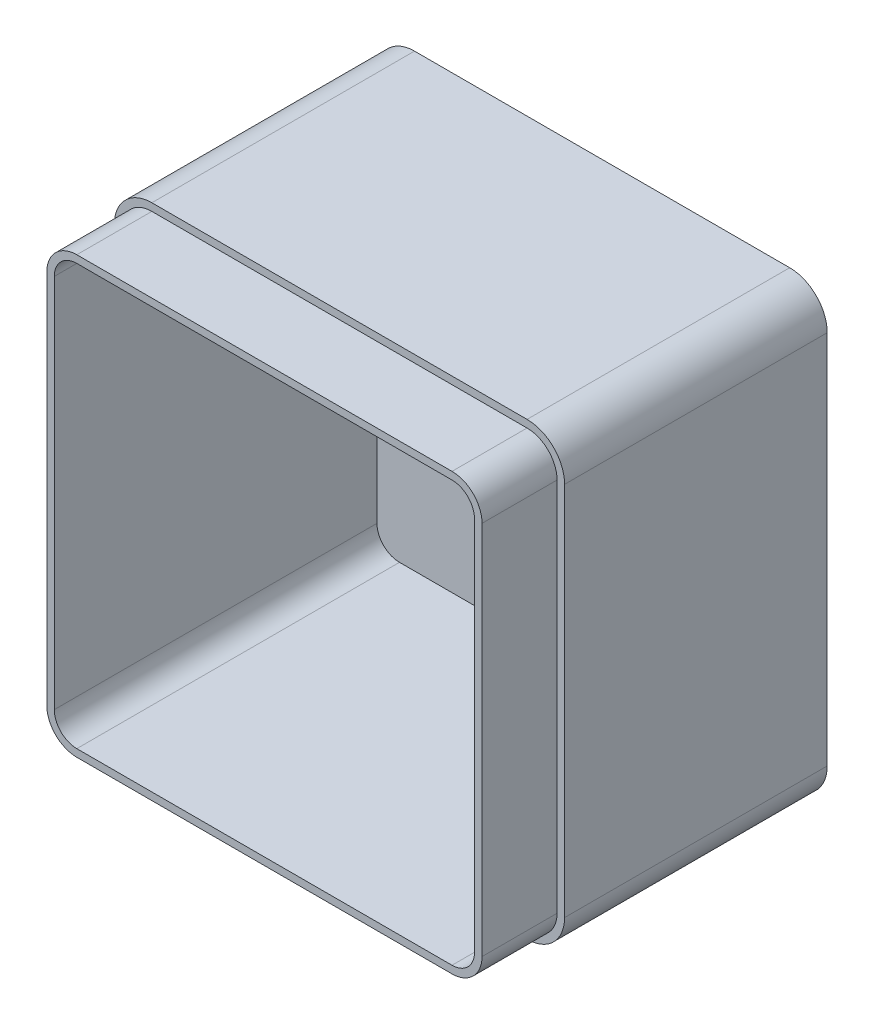
ISO-10303-21;
HEADER;
FILE_DESCRIPTION(('STEP AP214'),'2;1');
FILE_NAME('part.step','',(''),(''),'','','');
FILE_SCHEMA(('AUTOMOTIVE_DESIGN { 1 0 10303 214 1 1 1 1 }'));
ENDSEC;
DATA;
#1=APPLICATION_CONTEXT('core data for automotive mechanical design processes');
#2=APPLICATION_PROTOCOL_DEFINITION('international standard','automotive_design',2000,#1);
#3=PRODUCT_CONTEXT('',#1,'mechanical');
#4=PRODUCT('Part','Part','',(#3));
#5=PRODUCT_RELATED_PRODUCT_CATEGORY('part','',(#4));
#6=PRODUCT_DEFINITION_FORMATION('','',#4);
#7=PRODUCT_DEFINITION_CONTEXT('part definition',#1,'design');
#8=PRODUCT_DEFINITION('design','',#6,#7);
#9=PRODUCT_DEFINITION_SHAPE('','',#8);
#10=(LENGTH_UNIT() NAMED_UNIT(*) SI_UNIT(.MILLI.,.METRE.));
#11=(NAMED_UNIT(*) PLANE_ANGLE_UNIT() SI_UNIT($,.RADIAN.));
#12=(NAMED_UNIT(*) SI_UNIT($,.STERADIAN.) SOLID_ANGLE_UNIT());
#13=UNCERTAINTY_MEASURE_WITH_UNIT(LENGTH_MEASURE(1.E-05),#10,'distance_accuracy_value','');
#14=(GEOMETRIC_REPRESENTATION_CONTEXT(3) GLOBAL_UNCERTAINTY_ASSIGNED_CONTEXT((#13)) GLOBAL_UNIT_ASSIGNED_CONTEXT((#10,
#11,#12)) REPRESENTATION_CONTEXT('',''));
#15=CARTESIAN_POINT('',(0.,0.,0.));
#16=DIRECTION('',(0.,0.,1.));
#17=DIRECTION('',(1.,0.,0.));
#18=AXIS2_PLACEMENT_3D('',#15,#16,#17);
#19=CARTESIAN_POINT('',(0.,0.,90.));
#20=DIRECTION('',(0.,0.,-1.));
#21=DIRECTION('',(-1.,0.,0.));
#22=AXIS2_PLACEMENT_3D('',#19,#20,#21);
#23=PLANE('',#22);
#24=DIRECTION('',(1.,0.,0.));
#25=VECTOR('',#24,1.);
#26=CARTESIAN_POINT('',(0.,4.,90.));
#27=LINE('',#26,#25);
#28=CARTESIAN_POINT('',(9.99999999999999,4.,90.));
#29=VERTEX_POINT('',#28);
#30=CARTESIAN_POINT('',(110.,4.,90.));
#31=VERTEX_POINT('',#30);
#32=EDGE_CURVE('E384',#29,#31,#27,.T.);
#33=ORIENTED_EDGE('',*,*,#32,.F.);
#34=CARTESIAN_POINT('',(10.,10.,90.));
#35=DIRECTION('',(0.,0.,-1.));
#36=DIRECTION('',(-1.,0.,0.));
#37=AXIS2_PLACEMENT_3D('',#34,#35,#36);
#38=CIRCLE('',#37,6.);
#39=CARTESIAN_POINT('',(4.,9.99999999999999,90.));
#40=VERTEX_POINT('',#39);
#41=EDGE_CURVE('E385',#40,#29,#38,.F.);
#42=ORIENTED_EDGE('',*,*,#41,.F.);
#43=DIRECTION('',(0.,-1.,0.));
#44=VECTOR('',#43,1.);
#45=CARTESIAN_POINT('',(4.,0.,90.));
#46=LINE('',#45,#44);
#47=CARTESIAN_POINT('',(4.,110.,90.));
#48=VERTEX_POINT('',#47);
#49=EDGE_CURVE('E357',#48,#40,#46,.T.);
#50=ORIENTED_EDGE('',*,*,#49,.F.);
#51=CARTESIAN_POINT('',(10.,110.,90.));
#52=DIRECTION('',(0.,0.,-1.));
#53=DIRECTION('',(-1.,0.,0.));
#54=AXIS2_PLACEMENT_3D('',#51,#52,#53);
#55=CIRCLE('',#54,6.);
#56=CARTESIAN_POINT('',(9.99999999999999,116.,90.));
#57=VERTEX_POINT('',#56);
#58=EDGE_CURVE('E388',#57,#48,#55,.F.);
#59=ORIENTED_EDGE('',*,*,#58,.F.);
#60=DIRECTION('',(-1.,0.,0.));
#61=VECTOR('',#60,1.);
#62=CARTESIAN_POINT('',(0.,116.,90.));
#63=LINE('',#62,#61);
#64=CARTESIAN_POINT('',(110.,116.,90.));
#65=VERTEX_POINT('',#64);
#66=EDGE_CURVE('E374',#65,#57,#63,.T.);
#67=ORIENTED_EDGE('',*,*,#66,.F.);
#68=CARTESIAN_POINT('',(110.,110.,90.));
#69=DIRECTION('',(0.,0.,-1.));
#70=DIRECTION('',(-1.,0.,0.));
#71=AXIS2_PLACEMENT_3D('',#68,#69,#70);
#72=CIRCLE('',#71,6.);
#73=CARTESIAN_POINT('',(116.,110.,90.));
#74=VERTEX_POINT('',#73);
#75=EDGE_CURVE('E364',#74,#65,#72,.F.);
#76=ORIENTED_EDGE('',*,*,#75,.F.);
#77=DIRECTION('',(0.,1.,0.));
#78=VECTOR('',#77,1.);
#79=CARTESIAN_POINT('',(116.,0.,90.));
#80=LINE('',#79,#78);
#81=CARTESIAN_POINT('',(116.,9.99999999999999,90.));
#82=VERTEX_POINT('',#81);
#83=EDGE_CURVE('E392',#82,#74,#80,.T.);
#84=ORIENTED_EDGE('',*,*,#83,.F.);
#85=CARTESIAN_POINT('',(110.,10.,90.));
#86=DIRECTION('',(0.,0.,-1.));
#87=DIRECTION('',(-1.,0.,0.));
#88=AXIS2_PLACEMENT_3D('',#85,#86,#87);
#89=CIRCLE('',#88,6.);
#90=EDGE_CURVE('E334',#31,#82,#89,.F.);
#91=ORIENTED_EDGE('',*,*,#90,.F.);
#92=EDGE_LOOP('',(#33,#42,#50,#59,#67,#76,#84,#91));
#93=FACE_BOUND('',#92,.T.);
#94=CARTESIAN_POINT('',(10.,10.,90.));
#95=DIRECTION('',(0.,0.,1.));
#96=DIRECTION('',(1.,0.,0.));
#97=AXIS2_PLACEMENT_3D('',#94,#95,#96);
#98=CIRCLE('',#97,8.);
#99=CARTESIAN_POINT('',(2.,9.99999999999999,90.));
#100=VERTEX_POINT('',#99);
#101=CARTESIAN_POINT('',(10.,2.,90.));
#102=VERTEX_POINT('',#101);
#103=EDGE_CURVE('E256',#100,#102,#98,.T.);
#104=ORIENTED_EDGE('',*,*,#103,.T.);
#105=DIRECTION('',(1.,0.,0.));
#106=VECTOR('',#105,1.);
#107=CARTESIAN_POINT('',(10.,2.,90.));
#108=LINE('',#107,#106);
#109=CARTESIAN_POINT('',(110.,2.,90.));
#110=VERTEX_POINT('',#109);
#111=EDGE_CURVE('E206',#102,#110,#108,.T.);
#112=ORIENTED_EDGE('',*,*,#111,.T.);
#113=CARTESIAN_POINT('',(110.,10.,90.));
#114=DIRECTION('',(0.,0.,1.));
#115=DIRECTION('',(1.,0.,0.));
#116=AXIS2_PLACEMENT_3D('',#113,#114,#115);
#117=CIRCLE('',#116,7.99999999999999);
#118=CARTESIAN_POINT('',(118.,10.,90.));
#119=VERTEX_POINT('',#118);
#120=EDGE_CURVE('E54',#110,#119,#117,.T.);
#121=ORIENTED_EDGE('',*,*,#120,.T.);
#122=DIRECTION('',(0.,1.,0.));
#123=VECTOR('',#122,1.);
#124=CARTESIAN_POINT('',(118.,9.99999999999999,90.));
#125=LINE('',#124,#123);
#126=CARTESIAN_POINT('',(118.,110.,90.));
#127=VERTEX_POINT('',#126);
#128=EDGE_CURVE('E263',#119,#127,#125,.T.);
#129=ORIENTED_EDGE('',*,*,#128,.T.);
#130=CARTESIAN_POINT('',(110.,110.,90.));
#131=DIRECTION('',(0.,0.,1.));
#132=DIRECTION('',(1.,0.,0.));
#133=AXIS2_PLACEMENT_3D('',#130,#131,#132);
#134=CIRCLE('',#133,7.99999999999999);
#135=CARTESIAN_POINT('',(110.,118.,90.));
#136=VERTEX_POINT('',#135);
#137=EDGE_CURVE('E267',#127,#136,#134,.T.);
#138=ORIENTED_EDGE('',*,*,#137,.T.);
#139=DIRECTION('',(-1.,0.,0.));
#140=VECTOR('',#139,1.);
#141=CARTESIAN_POINT('',(110.,118.,90.));
#142=LINE('',#141,#140);
#143=CARTESIAN_POINT('',(9.99999999999999,118.,90.));
#144=VERTEX_POINT('',#143);
#145=EDGE_CURVE('E271',#136,#144,#142,.T.);
#146=ORIENTED_EDGE('',*,*,#145,.T.);
#147=CARTESIAN_POINT('',(10.,110.,90.));
#148=DIRECTION('',(0.,0.,1.));
#149=DIRECTION('',(1.,0.,0.));
#150=AXIS2_PLACEMENT_3D('',#147,#148,#149);
#151=CIRCLE('',#150,7.99999999999999);
#152=CARTESIAN_POINT('',(2.,110.,90.));
#153=VERTEX_POINT('',#152);
#154=EDGE_CURVE('E233',#144,#153,#151,.T.);
#155=ORIENTED_EDGE('',*,*,#154,.T.);
#156=DIRECTION('',(0.,-1.,0.));
#157=VECTOR('',#156,1.);
#158=CARTESIAN_POINT('',(2.,110.,90.));
#159=LINE('',#158,#157);
#160=EDGE_CURVE('E229',#153,#100,#159,.T.);
#161=ORIENTED_EDGE('',*,*,#160,.T.);
#162=EDGE_LOOP('',(#104,#112,#121,#129,#138,#146,#155,#161));
#163=FACE_BOUND('',#162,.T.);
#164=ADVANCED_FACE('F38',(#93,#163),#23,.F.);
#165=CARTESIAN_POINT('',(4.,0.,90.));
#166=DIRECTION('',(1.,0.,0.));
#167=DIRECTION('',(0.,0.,-1.));
#168=AXIS2_PLACEMENT_3D('',#165,#166,#167);
#169=PLANE('',#168);
#170=DIRECTION('',(0.,-1.,0.));
#171=VECTOR('',#170,1.);
#172=CARTESIAN_POINT('',(4.,0.,4.));
#173=LINE('',#172,#171);
#174=CARTESIAN_POINT('',(4.,110.,4.));
#175=VERTEX_POINT('',#174);
#176=CARTESIAN_POINT('',(4.,9.99999999999999,4.));
#177=VERTEX_POINT('',#176);
#178=EDGE_CURVE('E320',#175,#177,#173,.T.);
#179=ORIENTED_EDGE('',*,*,#178,.F.);
#180=DIRECTION('',(0.,0.,-1.));
#181=VECTOR('',#180,1.);
#182=CARTESIAN_POINT('',(4.,110.,90.));
#183=LINE('',#182,#181);
#184=EDGE_CURVE('E330',#48,#175,#183,.T.);
#185=ORIENTED_EDGE('',*,*,#184,.F.);
#186=ORIENTED_EDGE('',*,*,#49,.T.);
#187=DIRECTION('',(0.,0.,-1.));
#188=VECTOR('',#187,1.);
#189=CARTESIAN_POINT('',(4.,9.99999999999999,90.));
#190=LINE('',#189,#188);
#191=EDGE_CURVE('E325',#177,#40,#190,.F.);
#192=ORIENTED_EDGE('',*,*,#191,.F.);
#193=EDGE_LOOP('',(#179,#185,#186,#192));
#194=FACE_BOUND('',#193,.T.);
#195=ADVANCED_FACE('F503',(#194),#169,.T.);
#196=CARTESIAN_POINT('',(0.,4.,90.));
#197=DIRECTION('',(0.,1.,0.));
#198=DIRECTION('',(0.,0.,1.));
#199=AXIS2_PLACEMENT_3D('',#196,#197,#198);
#200=PLANE('',#199);
#201=DIRECTION('',(1.,0.,0.));
#202=VECTOR('',#201,1.);
#203=CARTESIAN_POINT('',(0.,4.,4.));
#204=LINE('',#203,#202);
#205=CARTESIAN_POINT('',(9.99999999999999,4.,4.));
#206=VERTEX_POINT('',#205);
#207=CARTESIAN_POINT('',(110.,4.,4.));
#208=VERTEX_POINT('',#207);
#209=EDGE_CURVE('E324',#206,#208,#204,.T.);
#210=ORIENTED_EDGE('',*,*,#209,.F.);
#211=DIRECTION('',(0.,0.,1.));
#212=VECTOR('',#211,1.);
#213=CARTESIAN_POINT('',(9.99999999999999,4.,90.));
#214=LINE('',#213,#212);
#215=EDGE_CURVE('E343',#29,#206,#214,.F.);
#216=ORIENTED_EDGE('',*,*,#215,.F.);
#217=ORIENTED_EDGE('',*,*,#32,.T.);
#218=DIRECTION('',(0.,0.,1.));
#219=VECTOR('',#218,1.);
#220=CARTESIAN_POINT('',(110.,4.,90.));
#221=LINE('',#220,#219);
#222=EDGE_CURVE('E361',#208,#31,#221,.T.);
#223=ORIENTED_EDGE('',*,*,#222,.F.);
#224=EDGE_LOOP('',(#210,#216,#217,#223));
#225=FACE_BOUND('',#224,.T.);
#226=ADVANCED_FACE('F511',(#225),#200,.T.);
#227=CARTESIAN_POINT('',(116.,0.,90.));
#228=DIRECTION('',(-1.,0.,0.));
#229=DIRECTION('',(0.,0.,1.));
#230=AXIS2_PLACEMENT_3D('',#227,#228,#229);
#231=PLANE('',#230);
#232=ORIENTED_EDGE('',*,*,#83,.T.);
#233=DIRECTION('',(0.,0.,1.));
#234=VECTOR('',#233,1.);
#235=CARTESIAN_POINT('',(116.,110.,90.));
#236=LINE('',#235,#234);
#237=CARTESIAN_POINT('',(116.,110.,4.));
#238=VERTEX_POINT('',#237);
#239=EDGE_CURVE('E371',#238,#74,#236,.T.);
#240=ORIENTED_EDGE('',*,*,#239,.F.);
#241=DIRECTION('',(0.,1.,0.));
#242=VECTOR('',#241,1.);
#243=CARTESIAN_POINT('',(116.,0.,4.));
#244=LINE('',#243,#242);
#245=CARTESIAN_POINT('',(116.,9.99999999999999,4.));
#246=VERTEX_POINT('',#245);
#247=EDGE_CURVE('E335',#246,#238,#244,.T.);
#248=ORIENTED_EDGE('',*,*,#247,.F.);
#249=DIRECTION('',(0.,0.,1.));
#250=VECTOR('',#249,1.);
#251=CARTESIAN_POINT('',(116.,9.99999999999999,90.));
#252=LINE('',#251,#250);
#253=EDGE_CURVE('E360',#82,#246,#252,.F.);
#254=ORIENTED_EDGE('',*,*,#253,.F.);
#255=EDGE_LOOP('',(#232,#240,#248,#254));
#256=FACE_BOUND('',#255,.T.);
#257=ADVANCED_FACE('F631',(#256),#231,.T.);
#258=CARTESIAN_POINT('',(0.,116.,90.));
#259=DIRECTION('',(0.,-1.,0.));
#260=DIRECTION('',(0.,0.,-1.));
#261=AXIS2_PLACEMENT_3D('',#258,#259,#260);
#262=PLANE('',#261);
#263=DIRECTION('',(-1.,0.,0.));
#264=VECTOR('',#263,1.);
#265=CARTESIAN_POINT('',(0.,116.,4.));
#266=LINE('',#265,#264);
#267=CARTESIAN_POINT('',(110.,116.,4.));
#268=VERTEX_POINT('',#267);
#269=CARTESIAN_POINT('',(9.99999999999999,116.,4.));
#270=VERTEX_POINT('',#269);
#271=EDGE_CURVE('E339',#268,#270,#266,.T.);
#272=ORIENTED_EDGE('',*,*,#271,.F.);
#273=DIRECTION('',(0.,0.,-1.));
#274=VECTOR('',#273,1.);
#275=CARTESIAN_POINT('',(110.,116.,90.));
#276=LINE('',#275,#274);
#277=EDGE_CURVE('E329',#65,#268,#276,.T.);
#278=ORIENTED_EDGE('',*,*,#277,.F.);
#279=ORIENTED_EDGE('',*,*,#66,.T.);
#280=DIRECTION('',(0.,0.,-1.));
#281=VECTOR('',#280,1.);
#282=CARTESIAN_POINT('',(9.99999999999999,116.,90.));
#283=LINE('',#282,#281);
#284=EDGE_CURVE('E378',#270,#57,#283,.F.);
#285=ORIENTED_EDGE('',*,*,#284,.F.);
#286=EDGE_LOOP('',(#272,#278,#279,#285));
#287=FACE_BOUND('',#286,.T.);
#288=ADVANCED_FACE('F635',(#287),#262,.T.);
#289=CARTESIAN_POINT('',(0.,0.,4.));
#290=DIRECTION('',(0.,0.,-1.));
#291=DIRECTION('',(-1.,0.,0.));
#292=AXIS2_PLACEMENT_3D('',#289,#290,#291);
#293=PLANE('',#292);
#294=ORIENTED_EDGE('',*,*,#247,.T.);
#295=CARTESIAN_POINT('',(110.,110.,4.));
#296=DIRECTION('',(0.,0.,-1.));
#297=DIRECTION('',(-1.,0.,0.));
#298=AXIS2_PLACEMENT_3D('',#295,#296,#297);
#299=CIRCLE('',#298,6.);
#300=EDGE_CURVE('E353',#268,#238,#299,.T.);
#301=ORIENTED_EDGE('',*,*,#300,.F.);
#302=ORIENTED_EDGE('',*,*,#271,.T.);
#303=CARTESIAN_POINT('',(10.,110.,4.));
#304=DIRECTION('',(0.,0.,-1.));
#305=DIRECTION('',(-1.,0.,0.));
#306=AXIS2_PLACEMENT_3D('',#303,#304,#305);
#307=CIRCLE('',#306,6.);
#308=EDGE_CURVE('E350',#175,#270,#307,.T.);
#309=ORIENTED_EDGE('',*,*,#308,.F.);
#310=ORIENTED_EDGE('',*,*,#178,.T.);
#311=CARTESIAN_POINT('',(10.,10.,4.));
#312=DIRECTION('',(0.,0.,-1.));
#313=DIRECTION('',(-1.,0.,0.));
#314=AXIS2_PLACEMENT_3D('',#311,#312,#313);
#315=CIRCLE('',#314,6.);
#316=EDGE_CURVE('E344',#206,#177,#315,.T.);
#317=ORIENTED_EDGE('',*,*,#316,.F.);
#318=ORIENTED_EDGE('',*,*,#209,.T.);
#319=CARTESIAN_POINT('',(110.,10.,4.));
#320=DIRECTION('',(0.,0.,-1.));
#321=DIRECTION('',(-1.,0.,0.));
#322=AXIS2_PLACEMENT_3D('',#319,#320,#321);
#323=CIRCLE('',#322,6.);
#324=EDGE_CURVE('E340',#246,#208,#323,.T.);
#325=ORIENTED_EDGE('',*,*,#324,.F.);
#326=EDGE_LOOP('',(#294,#301,#302,#309,#310,#317,#318,#325));
#327=FACE_BOUND('',#326,.T.);
#328=ADVANCED_FACE('F639',(#327),#293,.F.);
#329=CARTESIAN_POINT('',(110.,10.,90.));
#330=DIRECTION('',(0.,0.,-1.));
#331=DIRECTION('',(-1.,0.,0.));
#332=AXIS2_PLACEMENT_3D('',#329,#330,#331);
#333=CYLINDRICAL_SURFACE('',#332,6.);
#334=ORIENTED_EDGE('',*,*,#90,.T.);
#335=ORIENTED_EDGE('',*,*,#253,.T.);
#336=ORIENTED_EDGE('',*,*,#324,.T.);
#337=ORIENTED_EDGE('',*,*,#222,.T.);
#338=EDGE_LOOP('',(#334,#335,#336,#337));
#339=FACE_BOUND('',#338,.T.);
#340=ADVANCED_FACE('F643',(#339),#333,.F.);
#341=CARTESIAN_POINT('',(10.,10.,90.));
#342=DIRECTION('',(0.,0.,-1.));
#343=DIRECTION('',(-1.,0.,0.));
#344=AXIS2_PLACEMENT_3D('',#341,#342,#343);
#345=CYLINDRICAL_SURFACE('',#344,6.);
#346=ORIENTED_EDGE('',*,*,#41,.T.);
#347=ORIENTED_EDGE('',*,*,#215,.T.);
#348=ORIENTED_EDGE('',*,*,#316,.T.);
#349=ORIENTED_EDGE('',*,*,#191,.T.);
#350=EDGE_LOOP('',(#346,#347,#348,#349));
#351=FACE_BOUND('',#350,.T.);
#352=ADVANCED_FACE('F647',(#351),#345,.F.);
#353=CARTESIAN_POINT('',(10.,110.,90.));
#354=DIRECTION('',(0.,0.,-1.));
#355=DIRECTION('',(-1.,0.,0.));
#356=AXIS2_PLACEMENT_3D('',#353,#354,#355);
#357=CYLINDRICAL_SURFACE('',#356,6.);
#358=ORIENTED_EDGE('',*,*,#58,.T.);
#359=ORIENTED_EDGE('',*,*,#184,.T.);
#360=ORIENTED_EDGE('',*,*,#308,.T.);
#361=ORIENTED_EDGE('',*,*,#284,.T.);
#362=EDGE_LOOP('',(#358,#359,#360,#361));
#363=FACE_BOUND('',#362,.T.);
#364=ADVANCED_FACE('F650',(#363),#357,.F.);
#365=CARTESIAN_POINT('',(110.,110.,90.));
#366=DIRECTION('',(0.,0.,-1.));
#367=DIRECTION('',(-1.,0.,0.));
#368=AXIS2_PLACEMENT_3D('',#365,#366,#367);
#369=CYLINDRICAL_SURFACE('',#368,6.);
#370=ORIENTED_EDGE('',*,*,#75,.T.);
#371=ORIENTED_EDGE('',*,*,#277,.T.);
#372=ORIENTED_EDGE('',*,*,#300,.T.);
#373=ORIENTED_EDGE('',*,*,#239,.T.);
#374=EDGE_LOOP('',(#370,#371,#372,#373));
#375=FACE_BOUND('',#374,.T.);
#376=ADVANCED_FACE('F518',(#375),#369,.F.);
#377=CARTESIAN_POINT('',(10.,10.,70.));
#378=DIRECTION('',(0.,0.,1.));
#379=DIRECTION('',(1.,0.,0.));
#380=AXIS2_PLACEMENT_3D('',#377,#378,#379);
#381=PLANE('',#380);
#382=DIRECTION('',(0.,-1.,0.));
#383=VECTOR('',#382,1.);
#384=CARTESIAN_POINT('',(2.,110.,70.));
#385=LINE('',#384,#383);
#386=CARTESIAN_POINT('',(2.,110.,70.));
#387=VERTEX_POINT('',#386);
#388=CARTESIAN_POINT('',(2.,9.99999999999999,70.));
#389=VERTEX_POINT('',#388);
#390=EDGE_CURVE('E213',#387,#389,#385,.T.);
#391=ORIENTED_EDGE('',*,*,#390,.F.);
#392=CARTESIAN_POINT('',(10.,110.,70.));
#393=DIRECTION('',(0.,0.,1.));
#394=DIRECTION('',(1.,0.,0.));
#395=AXIS2_PLACEMENT_3D('',#392,#393,#394);
#396=CIRCLE('',#395,7.99999999999999);
#397=CARTESIAN_POINT('',(9.99999999999999,118.,70.));
#398=VERTEX_POINT('',#397);
#399=EDGE_CURVE('E250',#398,#387,#396,.T.);
#400=ORIENTED_EDGE('',*,*,#399,.F.);
#401=DIRECTION('',(-1.,0.,0.));
#402=VECTOR('',#401,1.);
#403=CARTESIAN_POINT('',(110.,118.,70.));
#404=LINE('',#403,#402);
#405=CARTESIAN_POINT('',(110.,118.,70.));
#406=VERTEX_POINT('',#405);
#407=EDGE_CURVE('E246',#406,#398,#404,.T.);
#408=ORIENTED_EDGE('',*,*,#407,.F.);
#409=CARTESIAN_POINT('',(110.,110.,70.));
#410=DIRECTION('',(0.,0.,1.));
#411=DIRECTION('',(1.,0.,0.));
#412=AXIS2_PLACEMENT_3D('',#409,#410,#411);
#413=CIRCLE('',#412,7.99999999999999);
#414=CARTESIAN_POINT('',(118.,110.,70.));
#415=VERTEX_POINT('',#414);
#416=EDGE_CURVE('E242',#415,#406,#413,.T.);
#417=ORIENTED_EDGE('',*,*,#416,.F.);
#418=DIRECTION('',(0.,1.,0.));
#419=VECTOR('',#418,1.);
#420=CARTESIAN_POINT('',(118.,9.99999999999999,70.));
#421=LINE('',#420,#419);
#422=CARTESIAN_POINT('',(118.,10.,70.));
#423=VERTEX_POINT('',#422);
#424=EDGE_CURVE('E238',#423,#415,#421,.T.);
#425=ORIENTED_EDGE('',*,*,#424,.F.);
#426=CARTESIAN_POINT('',(110.,10.,70.));
#427=DIRECTION('',(0.,0.,1.));
#428=DIRECTION('',(1.,0.,0.));
#429=AXIS2_PLACEMENT_3D('',#426,#427,#428);
#430=CIRCLE('',#429,7.99999999999999);
#431=CARTESIAN_POINT('',(110.,2.,70.));
#432=VERTEX_POINT('',#431);
#433=EDGE_CURVE('E223',#432,#423,#430,.T.);
#434=ORIENTED_EDGE('',*,*,#433,.F.);
#435=DIRECTION('',(1.,0.,0.));
#436=VECTOR('',#435,1.);
#437=CARTESIAN_POINT('',(10.,2.,70.));
#438=LINE('',#437,#436);
#439=CARTESIAN_POINT('',(10.,2.,70.));
#440=VERTEX_POINT('',#439);
#441=EDGE_CURVE('E204',#440,#432,#438,.T.);
#442=ORIENTED_EDGE('',*,*,#441,.F.);
#443=CARTESIAN_POINT('',(10.,10.,70.));
#444=DIRECTION('',(0.,0.,1.));
#445=DIRECTION('',(1.,0.,0.));
#446=AXIS2_PLACEMENT_3D('',#443,#444,#445);
#447=CIRCLE('',#446,8.);
#448=EDGE_CURVE('E219',#389,#440,#447,.T.);
#449=ORIENTED_EDGE('',*,*,#448,.F.);
#450=EDGE_LOOP('',(#391,#400,#408,#417,#425,#434,#442,#449));
#451=FACE_BOUND('',#450,.T.);
#452=CARTESIAN_POINT('',(10.,10.,70.));
#453=DIRECTION('',(0.,0.,1.));
#454=DIRECTION('',(1.,0.,0.));
#455=AXIS2_PLACEMENT_3D('',#452,#453,#454);
#456=CIRCLE('',#455,10.);
#457=CARTESIAN_POINT('',(0.,10.,70.));
#458=VERTEX_POINT('',#457);
#459=CARTESIAN_POINT('',(10.,0.,70.));
#460=VERTEX_POINT('',#459);
#461=EDGE_CURVE('E280',#458,#460,#456,.T.);
#462=ORIENTED_EDGE('',*,*,#461,.T.);
#463=DIRECTION('',(1.,0.,0.));
#464=VECTOR('',#463,1.);
#465=CARTESIAN_POINT('',(10.,0.,70.));
#466=LINE('',#465,#464);
#467=CARTESIAN_POINT('',(110.,0.,70.));
#468=VERTEX_POINT('',#467);
#469=EDGE_CURVE('E300',#460,#468,#466,.T.);
#470=ORIENTED_EDGE('',*,*,#469,.T.);
#471=CARTESIAN_POINT('',(110.,10.,70.));
#472=DIRECTION('',(0.,0.,1.));
#473=DIRECTION('',(1.,0.,0.));
#474=AXIS2_PLACEMENT_3D('',#471,#472,#473);
#475=CIRCLE('',#474,9.99999999999999);
#476=CARTESIAN_POINT('',(120.,10.,70.));
#477=VERTEX_POINT('',#476);
#478=EDGE_CURVE('E303',#468,#477,#475,.T.);
#479=ORIENTED_EDGE('',*,*,#478,.T.);
#480=DIRECTION('',(0.,1.,0.));
#481=VECTOR('',#480,1.);
#482=CARTESIAN_POINT('',(120.,10.,70.));
#483=LINE('',#482,#481);
#484=CARTESIAN_POINT('',(120.,110.,70.));
#485=VERTEX_POINT('',#484);
#486=EDGE_CURVE('E62',#477,#485,#483,.T.);
#487=ORIENTED_EDGE('',*,*,#486,.T.);
#488=CARTESIAN_POINT('',(110.,110.,70.));
#489=DIRECTION('',(0.,0.,1.));
#490=DIRECTION('',(1.,0.,0.));
#491=AXIS2_PLACEMENT_3D('',#488,#489,#490);
#492=CIRCLE('',#491,9.99999999999999);
#493=CARTESIAN_POINT('',(110.,120.,70.));
#494=VERTEX_POINT('',#493);
#495=EDGE_CURVE('E308',#485,#494,#492,.T.);
#496=ORIENTED_EDGE('',*,*,#495,.T.);
#497=DIRECTION('',(-1.,0.,0.));
#498=VECTOR('',#497,1.);
#499=CARTESIAN_POINT('',(110.,120.,70.));
#500=LINE('',#499,#498);
#501=CARTESIAN_POINT('',(10.,120.,70.));
#502=VERTEX_POINT('',#501);
#503=EDGE_CURVE('E311',#494,#502,#500,.T.);
#504=ORIENTED_EDGE('',*,*,#503,.T.);
#505=CARTESIAN_POINT('',(10.,110.,70.));
#506=DIRECTION('',(0.,0.,1.));
#507=DIRECTION('',(1.,0.,0.));
#508=AXIS2_PLACEMENT_3D('',#505,#506,#507);
#509=CIRCLE('',#508,9.99999999999999);
#510=CARTESIAN_POINT('',(0.,110.,70.));
#511=VERTEX_POINT('',#510);
#512=EDGE_CURVE('E314',#502,#511,#509,.T.);
#513=ORIENTED_EDGE('',*,*,#512,.T.);
#514=DIRECTION('',(0.,-1.,0.));
#515=VECTOR('',#514,1.);
#516=CARTESIAN_POINT('',(0.,110.,70.));
#517=LINE('',#516,#515);
#518=EDGE_CURVE('E317',#511,#458,#517,.T.);
#519=ORIENTED_EDGE('',*,*,#518,.T.);
#520=EDGE_LOOP('',(#462,#470,#479,#487,#496,#504,#513,#519));
#521=FACE_BOUND('',#520,.T.);
#522=ADVANCED_FACE('F218',(#451,#521),#381,.T.);
#523=CARTESIAN_POINT('',(10.,10.,70.));
#524=DIRECTION('',(0.,0.,1.));
#525=DIRECTION('',(1.,0.,0.));
#526=AXIS2_PLACEMENT_3D('',#523,#524,#525);
#527=CYLINDRICAL_SURFACE('',#526,8.);
#528=ORIENTED_EDGE('',*,*,#103,.F.);
#529=DIRECTION('',(0.,0.,1.));
#530=VECTOR('',#529,1.);
#531=CARTESIAN_POINT('',(2.,9.99999999999999,70.));
#532=LINE('',#531,#530);
#533=EDGE_CURVE('E227',#389,#100,#532,.T.);
#534=ORIENTED_EDGE('',*,*,#533,.F.);
#535=ORIENTED_EDGE('',*,*,#448,.T.);
#536=DIRECTION('',(0.,0.,1.));
#537=VECTOR('',#536,1.);
#538=CARTESIAN_POINT('',(10.,2.,70.));
#539=LINE('',#538,#537);
#540=EDGE_CURVE('E201',#440,#102,#539,.T.);
#541=ORIENTED_EDGE('',*,*,#540,.T.);
#542=EDGE_LOOP('',(#528,#534,#535,#541));
#543=FACE_BOUND('',#542,.T.);
#544=ADVANCED_FACE('F226',(#543),#527,.T.);
#545=CARTESIAN_POINT('',(2.,110.,70.));
#546=DIRECTION('',(-1.,0.,0.));
#547=DIRECTION('',(0.,-1.,0.));
#548=AXIS2_PLACEMENT_3D('',#545,#546,#547);
#549=PLANE('',#548);
#550=ORIENTED_EDGE('',*,*,#160,.F.);
#551=DIRECTION('',(0.,0.,1.));
#552=VECTOR('',#551,1.);
#553=CARTESIAN_POINT('',(2.,110.,70.));
#554=LINE('',#553,#552);
#555=EDGE_CURVE('E281',#387,#153,#554,.T.);
#556=ORIENTED_EDGE('',*,*,#555,.F.);
#557=ORIENTED_EDGE('',*,*,#390,.T.);
#558=ORIENTED_EDGE('',*,*,#533,.T.);
#559=EDGE_LOOP('',(#550,#556,#557,#558));
#560=FACE_BOUND('',#559,.T.);
#561=ADVANCED_FACE('F559',(#560),#549,.T.);
#562=CARTESIAN_POINT('',(10.,110.,70.));
#563=DIRECTION('',(0.,0.,1.));
#564=DIRECTION('',(1.,0.,0.));
#565=AXIS2_PLACEMENT_3D('',#562,#563,#564);
#566=CYLINDRICAL_SURFACE('',#565,7.99999999999999);
#567=ORIENTED_EDGE('',*,*,#154,.F.);
#568=DIRECTION('',(0.,0.,1.));
#569=VECTOR('',#568,1.);
#570=CARTESIAN_POINT('',(9.99999999999999,118.,70.));
#571=LINE('',#570,#569);
#572=EDGE_CURVE('E284',#398,#144,#571,.T.);
#573=ORIENTED_EDGE('',*,*,#572,.F.);
#574=ORIENTED_EDGE('',*,*,#399,.T.);
#575=ORIENTED_EDGE('',*,*,#555,.T.);
#576=EDGE_LOOP('',(#567,#573,#574,#575));
#577=FACE_BOUND('',#576,.T.);
#578=ADVANCED_FACE('F567',(#577),#566,.T.);
#579=CARTESIAN_POINT('',(110.,118.,70.));
#580=DIRECTION('',(0.,1.,0.));
#581=DIRECTION('',(0.,0.,1.));
#582=AXIS2_PLACEMENT_3D('',#579,#580,#581);
#583=PLANE('',#582);
#584=ORIENTED_EDGE('',*,*,#145,.F.);
#585=DIRECTION('',(0.,0.,1.));
#586=VECTOR('',#585,1.);
#587=CARTESIAN_POINT('',(110.,118.,70.));
#588=LINE('',#587,#586);
#589=EDGE_CURVE('E287',#406,#136,#588,.T.);
#590=ORIENTED_EDGE('',*,*,#589,.F.);
#591=ORIENTED_EDGE('',*,*,#407,.T.);
#592=ORIENTED_EDGE('',*,*,#572,.T.);
#593=EDGE_LOOP('',(#584,#590,#591,#592));
#594=FACE_BOUND('',#593,.T.);
#595=ADVANCED_FACE('F576',(#594),#583,.T.);
#596=CARTESIAN_POINT('',(110.,110.,70.));
#597=DIRECTION('',(0.,0.,1.));
#598=DIRECTION('',(1.,0.,0.));
#599=AXIS2_PLACEMENT_3D('',#596,#597,#598);
#600=CYLINDRICAL_SURFACE('',#599,7.99999999999999);
#601=ORIENTED_EDGE('',*,*,#137,.F.);
#602=DIRECTION('',(0.,0.,1.));
#603=VECTOR('',#602,1.);
#604=CARTESIAN_POINT('',(118.,110.,70.));
#605=LINE('',#604,#603);
#606=EDGE_CURVE('E290',#415,#127,#605,.T.);
#607=ORIENTED_EDGE('',*,*,#606,.F.);
#608=ORIENTED_EDGE('',*,*,#416,.T.);
#609=ORIENTED_EDGE('',*,*,#589,.T.);
#610=EDGE_LOOP('',(#601,#607,#608,#609));
#611=FACE_BOUND('',#610,.T.);
#612=ADVANCED_FACE('F585',(#611),#600,.T.);
#613=CARTESIAN_POINT('',(118.,9.99999999999999,70.));
#614=DIRECTION('',(1.,0.,0.));
#615=DIRECTION('',(0.,0.,-1.));
#616=AXIS2_PLACEMENT_3D('',#613,#614,#615);
#617=PLANE('',#616);
#618=ORIENTED_EDGE('',*,*,#128,.F.);
#619=DIRECTION('',(0.,0.,1.));
#620=VECTOR('',#619,1.);
#621=CARTESIAN_POINT('',(118.,10.,70.));
#622=LINE('',#621,#620);
#623=EDGE_CURVE('E293',#423,#119,#622,.T.);
#624=ORIENTED_EDGE('',*,*,#623,.F.);
#625=ORIENTED_EDGE('',*,*,#424,.T.);
#626=ORIENTED_EDGE('',*,*,#606,.T.);
#627=EDGE_LOOP('',(#618,#624,#625,#626));
#628=FACE_BOUND('',#627,.T.);
#629=ADVANCED_FACE('F594',(#628),#617,.T.);
#630=CARTESIAN_POINT('',(110.,10.,70.));
#631=DIRECTION('',(0.,0.,1.));
#632=DIRECTION('',(1.,0.,0.));
#633=AXIS2_PLACEMENT_3D('',#630,#631,#632);
#634=CYLINDRICAL_SURFACE('',#633,7.99999999999999);
#635=ORIENTED_EDGE('',*,*,#120,.F.);
#636=DIRECTION('',(0.,0.,1.));
#637=VECTOR('',#636,1.);
#638=CARTESIAN_POINT('',(110.,2.,70.));
#639=LINE('',#638,#637);
#640=EDGE_CURVE('E212',#432,#110,#639,.T.);
#641=ORIENTED_EDGE('',*,*,#640,.F.);
#642=ORIENTED_EDGE('',*,*,#433,.T.);
#643=ORIENTED_EDGE('',*,*,#623,.T.);
#644=EDGE_LOOP('',(#635,#641,#642,#643));
#645=FACE_BOUND('',#644,.T.);
#646=ADVANCED_FACE('F603',(#645),#634,.T.);
#647=CARTESIAN_POINT('',(10.,2.,70.));
#648=DIRECTION('',(0.,-1.,0.));
#649=DIRECTION('',(0.,0.,-1.));
#650=AXIS2_PLACEMENT_3D('',#647,#648,#649);
#651=PLANE('',#650);
#652=ORIENTED_EDGE('',*,*,#111,.F.);
#653=ORIENTED_EDGE('',*,*,#540,.F.);
#654=ORIENTED_EDGE('',*,*,#441,.T.);
#655=ORIENTED_EDGE('',*,*,#640,.T.);
#656=EDGE_LOOP('',(#652,#653,#654,#655));
#657=FACE_BOUND('',#656,.T.);
#658=ADVANCED_FACE('F203',(#657),#651,.T.);
#659=CARTESIAN_POINT('',(0.,0.,0.));
#660=DIRECTION('',(0.,0.,-1.));
#661=DIRECTION('',(-1.,0.,0.));
#662=AXIS2_PLACEMENT_3D('',#659,#660,#661);
#663=PLANE('',#662);
#664=DIRECTION('',(0.,1.,0.));
#665=VECTOR('',#664,1.);
#666=CARTESIAN_POINT('',(120.,0.,0.));
#667=LINE('',#666,#665);
#668=CARTESIAN_POINT('',(120.,10.,0.));
#669=VERTEX_POINT('',#668);
#670=CARTESIAN_POINT('',(120.,110.,0.));
#671=VERTEX_POINT('',#670);
#672=EDGE_CURVE('E412',#669,#671,#667,.T.);
#673=ORIENTED_EDGE('',*,*,#672,.F.);
#674=CARTESIAN_POINT('',(110.,10.,0.));
#675=DIRECTION('',(0.,0.,-1.));
#676=DIRECTION('',(-1.,0.,0.));
#677=AXIS2_PLACEMENT_3D('',#674,#675,#676);
#678=CIRCLE('',#677,10.);
#679=CARTESIAN_POINT('',(110.,0.,0.));
#680=VERTEX_POINT('',#679);
#681=EDGE_CURVE('E436',#669,#680,#678,.T.);
#682=ORIENTED_EDGE('',*,*,#681,.T.);
#683=DIRECTION('',(1.,0.,0.));
#684=VECTOR('',#683,1.);
#685=CARTESIAN_POINT('',(0.,0.,0.));
#686=LINE('',#685,#684);
#687=CARTESIAN_POINT('',(10.,0.,0.));
#688=VERTEX_POINT('',#687);
#689=EDGE_CURVE('E408',#688,#680,#686,.T.);
#690=ORIENTED_EDGE('',*,*,#689,.F.);
#691=CARTESIAN_POINT('',(10.,10.,0.));
#692=DIRECTION('',(0.,0.,-1.));
#693=DIRECTION('',(-1.,0.,0.));
#694=AXIS2_PLACEMENT_3D('',#691,#692,#693);
#695=CIRCLE('',#694,10.);
#696=CARTESIAN_POINT('',(0.,10.,0.));
#697=VERTEX_POINT('',#696);
#698=EDGE_CURVE('E433',#688,#697,#695,.T.);
#699=ORIENTED_EDGE('',*,*,#698,.T.);
#700=DIRECTION('',(0.,-1.,0.));
#701=VECTOR('',#700,1.);
#702=CARTESIAN_POINT('',(0.,0.,0.));
#703=LINE('',#702,#701);
#704=CARTESIAN_POINT('',(0.,110.,0.));
#705=VERTEX_POINT('',#704);
#706=EDGE_CURVE('E381',#705,#697,#703,.T.);
#707=ORIENTED_EDGE('',*,*,#706,.F.);
#708=CARTESIAN_POINT('',(10.,110.,0.));
#709=DIRECTION('',(0.,0.,-1.));
#710=DIRECTION('',(-1.,0.,0.));
#711=AXIS2_PLACEMENT_3D('',#708,#709,#710);
#712=CIRCLE('',#711,10.);
#713=CARTESIAN_POINT('',(10.,120.,0.));
#714=VERTEX_POINT('',#713);
#715=EDGE_CURVE('E430',#705,#714,#712,.T.);
#716=ORIENTED_EDGE('',*,*,#715,.T.);
#717=DIRECTION('',(-1.,0.,0.));
#718=VECTOR('',#717,1.);
#719=CARTESIAN_POINT('',(0.,120.,0.));
#720=LINE('',#719,#718);
#721=CARTESIAN_POINT('',(110.,120.,0.));
#722=VERTEX_POINT('',#721);
#723=EDGE_CURVE('E416',#722,#714,#720,.T.);
#724=ORIENTED_EDGE('',*,*,#723,.F.);
#725=CARTESIAN_POINT('',(110.,110.,0.));
#726=DIRECTION('',(0.,0.,-1.));
#727=DIRECTION('',(-1.,0.,0.));
#728=AXIS2_PLACEMENT_3D('',#725,#726,#727);
#729=CIRCLE('',#728,10.);
#730=EDGE_CURVE('E427',#722,#671,#729,.T.);
#731=ORIENTED_EDGE('',*,*,#730,.T.);
#732=EDGE_LOOP('',(#673,#682,#690,#699,#707,#716,#724,#731));
#733=FACE_BOUND('',#732,.T.);
#734=ADVANCED_FACE('F464',(#733),#663,.T.);
#735=CARTESIAN_POINT('',(10.,110.,90.));
#736=DIRECTION('',(0.,0.,-1.));
#737=DIRECTION('',(-1.,0.,0.));
#738=AXIS2_PLACEMENT_3D('',#735,#736,#737);
#739=CYLINDRICAL_SURFACE('',#738,10.);
#740=DIRECTION('',(0.,0.,-1.));
#741=VECTOR('',#740,1.);
#742=CARTESIAN_POINT('',(0.,110.,90.));
#743=LINE('',#742,#741);
#744=EDGE_CURVE('E446',#511,#705,#743,.T.);
#745=ORIENTED_EDGE('',*,*,#744,.F.);
#746=ORIENTED_EDGE('',*,*,#512,.F.);
#747=DIRECTION('',(0.,0.,-1.));
#748=VECTOR('',#747,1.);
#749=CARTESIAN_POINT('',(10.,120.,90.));
#750=LINE('',#749,#748);
#751=EDGE_CURVE('E11',#714,#502,#750,.F.);
#752=ORIENTED_EDGE('',*,*,#751,.F.);
#753=ORIENTED_EDGE('',*,*,#715,.F.);
#754=EDGE_LOOP('',(#745,#746,#752,#753));
#755=FACE_BOUND('',#754,.T.);
#756=ADVANCED_FACE('F469',(#755),#739,.T.);
#757=CARTESIAN_POINT('',(110.,110.,90.));
#758=DIRECTION('',(0.,0.,-1.));
#759=DIRECTION('',(-1.,0.,0.));
#760=AXIS2_PLACEMENT_3D('',#757,#758,#759);
#761=CYLINDRICAL_SURFACE('',#760,10.);
#762=DIRECTION('',(0.,0.,-1.));
#763=VECTOR('',#762,1.);
#764=CARTESIAN_POINT('',(110.,120.,90.));
#765=LINE('',#764,#763);
#766=EDGE_CURVE('E47',#494,#722,#765,.T.);
#767=ORIENTED_EDGE('',*,*,#766,.F.);
#768=ORIENTED_EDGE('',*,*,#495,.F.);
#769=DIRECTION('',(0.,0.,-1.));
#770=VECTOR('',#769,1.);
#771=CARTESIAN_POINT('',(120.,110.,90.));
#772=LINE('',#771,#770);
#773=EDGE_CURVE('E420',#671,#485,#772,.F.);
#774=ORIENTED_EDGE('',*,*,#773,.F.);
#775=ORIENTED_EDGE('',*,*,#730,.F.);
#776=EDGE_LOOP('',(#767,#768,#774,#775));
#777=FACE_BOUND('',#776,.T.);
#778=ADVANCED_FACE('F40',(#777),#761,.T.);
#779=CARTESIAN_POINT('',(0.,120.,90.));
#780=DIRECTION('',(0.,-1.,0.));
#781=DIRECTION('',(0.,0.,-1.));
#782=AXIS2_PLACEMENT_3D('',#779,#780,#781);
#783=PLANE('',#782);
#784=ORIENTED_EDGE('',*,*,#503,.F.);
#785=ORIENTED_EDGE('',*,*,#766,.T.);
#786=ORIENTED_EDGE('',*,*,#723,.T.);
#787=ORIENTED_EDGE('',*,*,#751,.T.);
#788=EDGE_LOOP('',(#784,#785,#786,#787));
#789=FACE_BOUND('',#788,.T.);
#790=ADVANCED_FACE('F457',(#789),#783,.F.);
#791=CARTESIAN_POINT('',(110.,10.,90.));
#792=DIRECTION('',(0.,0.,-1.));
#793=DIRECTION('',(-1.,0.,0.));
#794=AXIS2_PLACEMENT_3D('',#791,#792,#793);
#795=CYLINDRICAL_SURFACE('',#794,10.);
#796=DIRECTION('',(0.,0.,-1.));
#797=VECTOR('',#796,1.);
#798=CARTESIAN_POINT('',(120.,10.,90.));
#799=LINE('',#798,#797);
#800=EDGE_CURVE('E424',#477,#669,#799,.T.);
#801=ORIENTED_EDGE('',*,*,#800,.F.);
#802=ORIENTED_EDGE('',*,*,#478,.F.);
#803=DIRECTION('',(0.,0.,-1.));
#804=VECTOR('',#803,1.);
#805=CARTESIAN_POINT('',(110.,0.,90.));
#806=LINE('',#805,#804);
#807=EDGE_CURVE('E442',#680,#468,#806,.F.);
#808=ORIENTED_EDGE('',*,*,#807,.F.);
#809=ORIENTED_EDGE('',*,*,#681,.F.);
#810=EDGE_LOOP('',(#801,#802,#808,#809));
#811=FACE_BOUND('',#810,.T.);
#812=ADVANCED_FACE('F489',(#811),#795,.T.);
#813=CARTESIAN_POINT('',(120.,0.,90.));
#814=DIRECTION('',(-1.,0.,0.));
#815=DIRECTION('',(0.,0.,1.));
#816=AXIS2_PLACEMENT_3D('',#813,#814,#815);
#817=PLANE('',#816);
#818=ORIENTED_EDGE('',*,*,#486,.F.);
#819=ORIENTED_EDGE('',*,*,#800,.T.);
#820=ORIENTED_EDGE('',*,*,#672,.T.);
#821=ORIENTED_EDGE('',*,*,#773,.T.);
#822=EDGE_LOOP('',(#818,#819,#820,#821));
#823=FACE_BOUND('',#822,.T.);
#824=ADVANCED_FACE('F491',(#823),#817,.F.);
#825=CARTESIAN_POINT('',(10.,10.,90.));
#826=DIRECTION('',(0.,0.,-1.));
#827=DIRECTION('',(-1.,0.,0.));
#828=AXIS2_PLACEMENT_3D('',#825,#826,#827);
#829=CYLINDRICAL_SURFACE('',#828,10.);
#830=DIRECTION('',(0.,0.,-1.));
#831=VECTOR('',#830,1.);
#832=CARTESIAN_POINT('',(10.,0.,90.));
#833=LINE('',#832,#831);
#834=EDGE_CURVE('E439',#460,#688,#833,.T.);
#835=ORIENTED_EDGE('',*,*,#834,.F.);
#836=ORIENTED_EDGE('',*,*,#461,.F.);
#837=DIRECTION('',(0.,0.,-1.));
#838=VECTOR('',#837,1.);
#839=CARTESIAN_POINT('',(0.,10.,90.));
#840=LINE('',#839,#838);
#841=EDGE_CURVE('E449',#697,#458,#840,.F.);
#842=ORIENTED_EDGE('',*,*,#841,.F.);
#843=ORIENTED_EDGE('',*,*,#698,.F.);
#844=EDGE_LOOP('',(#835,#836,#842,#843));
#845=FACE_BOUND('',#844,.T.);
#846=ADVANCED_FACE('F479',(#845),#829,.T.);
#847=CARTESIAN_POINT('',(0.,0.,90.));
#848=DIRECTION('',(0.,1.,0.));
#849=DIRECTION('',(0.,0.,1.));
#850=AXIS2_PLACEMENT_3D('',#847,#848,#849);
#851=PLANE('',#850);
#852=ORIENTED_EDGE('',*,*,#469,.F.);
#853=ORIENTED_EDGE('',*,*,#834,.T.);
#854=ORIENTED_EDGE('',*,*,#689,.T.);
#855=ORIENTED_EDGE('',*,*,#807,.T.);
#856=EDGE_LOOP('',(#852,#853,#854,#855));
#857=FACE_BOUND('',#856,.T.);
#858=ADVANCED_FACE('F484',(#857),#851,.F.);
#859=CARTESIAN_POINT('',(0.,0.,90.));
#860=DIRECTION('',(1.,0.,0.));
#861=DIRECTION('',(0.,0.,-1.));
#862=AXIS2_PLACEMENT_3D('',#859,#860,#861);
#863=PLANE('',#862);
#864=ORIENTED_EDGE('',*,*,#518,.F.);
#865=ORIENTED_EDGE('',*,*,#744,.T.);
#866=ORIENTED_EDGE('',*,*,#706,.T.);
#867=ORIENTED_EDGE('',*,*,#841,.T.);
#868=EDGE_LOOP('',(#864,#865,#866,#867));
#869=FACE_BOUND('',#868,.T.);
#870=ADVANCED_FACE('F474',(#869),#863,.F.);
#871=CLOSED_SHELL('',(#164,#195,#226,#257,#288,#328,#340,#352,#364,#376,#522,#544,#561,#578,
#595,#612,#629,#646,#658,#734,#756,#778,#790,#812,#824,#846,#858,#870));
#872=MANIFOLD_SOLID_BREP('B2',#871);
#873=ADVANCED_BREP_SHAPE_REPRESENTATION('',(#18,#872),#14);
#874=SHAPE_DEFINITION_REPRESENTATION(#9,#873);
ENDSEC;
END-ISO-10303-21;
